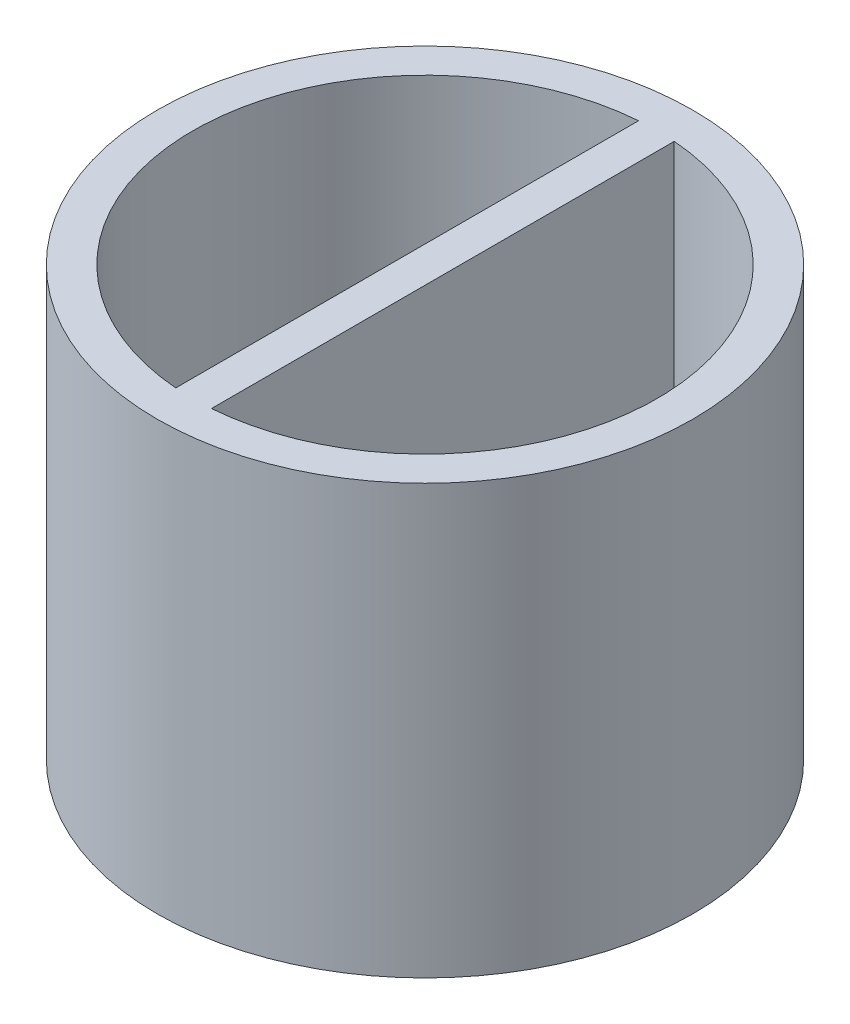
ISO-10303-21;
HEADER;
FILE_DESCRIPTION(('STEP AP214'),'2;1');
FILE_NAME('part.step','',(''),(''),'','','');
FILE_SCHEMA(('AUTOMOTIVE_DESIGN { 1 0 10303 214 1 1 1 1 }'));
ENDSEC;
DATA;
#1=APPLICATION_CONTEXT('core data for automotive mechanical design processes');
#2=APPLICATION_PROTOCOL_DEFINITION('international standard','automotive_design',2000,#1);
#3=PRODUCT_CONTEXT('',#1,'mechanical');
#4=PRODUCT('Part','Part','',(#3));
#5=PRODUCT_RELATED_PRODUCT_CATEGORY('part','',(#4));
#6=PRODUCT_DEFINITION_FORMATION('','',#4);
#7=PRODUCT_DEFINITION_CONTEXT('part definition',#1,'design');
#8=PRODUCT_DEFINITION('design','',#6,#7);
#9=PRODUCT_DEFINITION_SHAPE('','',#8);
#10=(LENGTH_UNIT() NAMED_UNIT(*) SI_UNIT(.MILLI.,.METRE.));
#11=(NAMED_UNIT(*) PLANE_ANGLE_UNIT() SI_UNIT($,.RADIAN.));
#12=(NAMED_UNIT(*) SI_UNIT($,.STERADIAN.) SOLID_ANGLE_UNIT());
#13=UNCERTAINTY_MEASURE_WITH_UNIT(LENGTH_MEASURE(1.E-05),#10,'distance_accuracy_value','');
#14=(GEOMETRIC_REPRESENTATION_CONTEXT(3) GLOBAL_UNCERTAINTY_ASSIGNED_CONTEXT((#13)) GLOBAL_UNIT_ASSIGNED_CONTEXT((#10,
#11,#12)) REPRESENTATION_CONTEXT('',''));
#15=CARTESIAN_POINT('',(0.,0.,0.));
#16=DIRECTION('',(0.,0.,1.));
#17=DIRECTION('',(1.,0.,0.));
#18=AXIS2_PLACEMENT_3D('',#15,#16,#17);
#19=CARTESIAN_POINT('',(0.,60.,0.));
#20=DIRECTION('',(0.,1.,0.));
#21=DIRECTION('',(0.,0.,1.));
#22=AXIS2_PLACEMENT_3D('',#19,#20,#21);
#23=PLANE('',#22);
#24=DIRECTION('',(0.,0.,1.));
#25=VECTOR('',#24,1.);
#26=CARTESIAN_POINT('',(2.5,60.,0.));
#27=LINE('',#26,#25);
#28=CARTESIAN_POINT('',(2.5,60.,-32.4037034920393));
#29=VERTEX_POINT('',#28);
#30=CARTESIAN_POINT('',(2.5,60.,32.4037034920393));
#31=VERTEX_POINT('',#30);
#32=EDGE_CURVE('E69',#29,#31,#27,.T.);
#33=ORIENTED_EDGE('',*,*,#32,.F.);
#34=CARTESIAN_POINT('',(0.,60.,0.));
#35=DIRECTION('',(0.,1.,0.));
#36=DIRECTION('',(0.,0.,1.));
#37=AXIS2_PLACEMENT_3D('',#34,#35,#36);
#38=CIRCLE('',#37,32.5);
#39=EDGE_CURVE('E120',#31,#29,#38,.T.);
#40=ORIENTED_EDGE('',*,*,#39,.F.);
#41=EDGE_LOOP('',(#33,#40));
#42=FACE_BOUND('',#41,.T.);
#43=CARTESIAN_POINT('',(0.,60.,0.));
#44=DIRECTION('',(0.,1.,0.));
#45=DIRECTION('',(0.,0.,1.));
#46=AXIS2_PLACEMENT_3D('',#43,#44,#45);
#47=CIRCLE('',#46,37.5);
#48=CARTESIAN_POINT('',(0.,60.,37.5));
#49=VERTEX_POINT('',#48);
#50=EDGE_CURVE('E11',#49,#49,#47,.T.);
#51=ORIENTED_EDGE('',*,*,#50,.T.);
#52=EDGE_LOOP('',(#51));
#53=FACE_BOUND('',#52,.T.);
#54=CARTESIAN_POINT('',(0.,60.,0.));
#55=DIRECTION('',(0.,1.,0.));
#56=DIRECTION('',(0.,0.,1.));
#57=AXIS2_PLACEMENT_3D('',#54,#55,#56);
#58=CIRCLE('',#57,32.5);
#59=CARTESIAN_POINT('',(-2.5,60.,-32.4037034920393));
#60=VERTEX_POINT('',#59);
#61=CARTESIAN_POINT('',(-2.5,60.,32.4037034920393));
#62=VERTEX_POINT('',#61);
#63=EDGE_CURVE('E101',#60,#62,#58,.T.);
#64=ORIENTED_EDGE('',*,*,#63,.F.);
#65=DIRECTION('',(0.,0.,1.));
#66=VECTOR('',#65,1.);
#67=CARTESIAN_POINT('',(-2.5,60.,0.));
#68=LINE('',#67,#66);
#69=EDGE_CURVE('E61',#60,#62,#68,.T.);
#70=ORIENTED_EDGE('',*,*,#69,.T.);
#71=EDGE_LOOP('',(#64,#70));
#72=FACE_BOUND('',#71,.T.);
#73=ADVANCED_FACE('F45',(#42,#53,#72),#23,.T.);
#74=CARTESIAN_POINT('',(0.,60.,0.));
#75=DIRECTION('',(0.,-1.,0.));
#76=DIRECTION('',(0.,0.,-1.));
#77=AXIS2_PLACEMENT_3D('',#74,#75,#76);
#78=CYLINDRICAL_SURFACE('',#77,37.5);
#79=ORIENTED_EDGE('',*,*,#50,.F.);
#80=EDGE_LOOP('',(#79));
#81=FACE_BOUND('',#80,.T.);
#82=CARTESIAN_POINT('',(0.,0.,0.));
#83=DIRECTION('',(0.,1.,0.));
#84=DIRECTION('',(0.,0.,1.));
#85=AXIS2_PLACEMENT_3D('',#82,#83,#84);
#86=CIRCLE('',#85,37.5);
#87=CARTESIAN_POINT('',(0.,0.,37.5));
#88=VERTEX_POINT('',#87);
#89=EDGE_CURVE('E49',#88,#88,#86,.T.);
#90=ORIENTED_EDGE('',*,*,#89,.T.);
#91=EDGE_LOOP('',(#90));
#92=FACE_BOUND('',#91,.T.);
#93=ADVANCED_FACE('F47',(#81,#92),#78,.T.);
#94=CARTESIAN_POINT('',(0.,0.,0.));
#95=DIRECTION('',(0.,1.,0.));
#96=DIRECTION('',(0.,0.,1.));
#97=AXIS2_PLACEMENT_3D('',#94,#95,#96);
#98=PLANE('',#97);
#99=CARTESIAN_POINT('',(0.,0.,0.));
#100=DIRECTION('',(0.,-1.,0.));
#101=DIRECTION('',(0.,0.,-1.));
#102=AXIS2_PLACEMENT_3D('',#99,#100,#101);
#103=CIRCLE('',#102,10.35);
#104=CARTESIAN_POINT('',(0.,0.,-10.35));
#105=VERTEX_POINT('',#104);
#106=EDGE_CURVE('E186',#105,#105,#103,.T.);
#107=ORIENTED_EDGE('',*,*,#106,.F.);
#108=EDGE_LOOP('',(#107));
#109=FACE_BOUND('',#108,.T.);
#110=ORIENTED_EDGE('',*,*,#89,.F.);
#111=EDGE_LOOP('',(#110));
#112=FACE_BOUND('',#111,.T.);
#113=ADVANCED_FACE('F148',(#109,#112),#98,.F.);
#114=CARTESIAN_POINT('',(2.5,9.99999999999999,0.));
#115=DIRECTION('',(-1.,0.,0.));
#116=DIRECTION('',(0.,0.,1.));
#117=AXIS2_PLACEMENT_3D('',#114,#115,#116);
#118=PLANE('',#117);
#119=ORIENTED_EDGE('',*,*,#32,.T.);
#120=DIRECTION('',(0.,1.,0.));
#121=VECTOR('',#120,1.);
#122=CARTESIAN_POINT('',(2.5,9.99999999999999,32.4037034920393));
#123=LINE('',#122,#121);
#124=CARTESIAN_POINT('',(2.5,9.99999999999999,32.4037034920393));
#125=VERTEX_POINT('',#124);
#126=EDGE_CURVE('E124',#125,#31,#123,.T.);
#127=ORIENTED_EDGE('',*,*,#126,.F.);
#128=DIRECTION('',(0.,0.,1.));
#129=VECTOR('',#128,1.);
#130=CARTESIAN_POINT('',(2.5,9.99999999999999,0.));
#131=LINE('',#130,#129);
#132=CARTESIAN_POINT('',(2.5,9.99999999999999,-32.4037034920393));
#133=VERTEX_POINT('',#132);
#134=EDGE_CURVE('E115',#133,#125,#131,.T.);
#135=ORIENTED_EDGE('',*,*,#134,.F.);
#136=DIRECTION('',(0.,1.,0.));
#137=VECTOR('',#136,1.);
#138=CARTESIAN_POINT('',(2.5,9.99999999999999,-32.4037034920393));
#139=LINE('',#138,#137);
#140=EDGE_CURVE('E110',#133,#29,#139,.T.);
#141=ORIENTED_EDGE('',*,*,#140,.T.);
#142=EDGE_LOOP('',(#119,#127,#135,#141));
#143=FACE_BOUND('',#142,.T.);
#144=ADVANCED_FACE('F154',(#143),#118,.F.);
#145=CARTESIAN_POINT('',(0.,9.99999999999999,0.));
#146=DIRECTION('',(0.,1.,0.));
#147=DIRECTION('',(0.,0.,1.));
#148=AXIS2_PLACEMENT_3D('',#145,#146,#147);
#149=CYLINDRICAL_SURFACE('',#148,32.5);
#150=ORIENTED_EDGE('',*,*,#39,.T.);
#151=ORIENTED_EDGE('',*,*,#140,.F.);
#152=CARTESIAN_POINT('',(0.,9.99999999999999,0.));
#153=DIRECTION('',(0.,1.,0.));
#154=DIRECTION('',(0.,0.,1.));
#155=AXIS2_PLACEMENT_3D('',#152,#153,#154);
#156=CIRCLE('',#155,32.5);
#157=EDGE_CURVE('E119',#125,#133,#156,.T.);
#158=ORIENTED_EDGE('',*,*,#157,.F.);
#159=ORIENTED_EDGE('',*,*,#126,.T.);
#160=EDGE_LOOP('',(#150,#151,#158,#159));
#161=FACE_BOUND('',#160,.T.);
#162=ADVANCED_FACE('F137',(#161),#149,.F.);
#163=CARTESIAN_POINT('',(0.,9.99999999999999,0.));
#164=DIRECTION('',(0.,1.,0.));
#165=DIRECTION('',(0.,0.,1.));
#166=AXIS2_PLACEMENT_3D('',#163,#164,#165);
#167=PLANE('',#166);
#168=ORIENTED_EDGE('',*,*,#134,.T.);
#169=ORIENTED_EDGE('',*,*,#157,.T.);
#170=EDGE_LOOP('',(#168,#169));
#171=FACE_BOUND('',#170,.T.);
#172=ADVANCED_FACE('F166',(#171),#167,.T.);
#173=CARTESIAN_POINT('',(-2.5,9.99999999999999,0.));
#174=DIRECTION('',(-1.,0.,0.));
#175=DIRECTION('',(0.,0.,1.));
#176=AXIS2_PLACEMENT_3D('',#173,#174,#175);
#177=PLANE('',#176);
#178=ORIENTED_EDGE('',*,*,#69,.F.);
#179=DIRECTION('',(0.,1.,0.));
#180=VECTOR('',#179,1.);
#181=CARTESIAN_POINT('',(-2.5,9.99999999999999,-32.4037034920393));
#182=LINE('',#181,#180);
#183=CARTESIAN_POINT('',(-2.5,9.99999999999999,-32.4037034920393));
#184=VERTEX_POINT('',#183);
#185=EDGE_CURVE('E84',#184,#60,#182,.T.);
#186=ORIENTED_EDGE('',*,*,#185,.F.);
#187=DIRECTION('',(0.,0.,1.));
#188=VECTOR('',#187,1.);
#189=CARTESIAN_POINT('',(-2.5,9.99999999999999,0.));
#190=LINE('',#189,#188);
#191=CARTESIAN_POINT('',(-2.5,9.99999999999999,32.4037034920393));
#192=VERTEX_POINT('',#191);
#193=EDGE_CURVE('E87',#184,#192,#190,.T.);
#194=ORIENTED_EDGE('',*,*,#193,.T.);
#195=DIRECTION('',(0.,1.,0.));
#196=VECTOR('',#195,1.);
#197=CARTESIAN_POINT('',(-2.5,9.99999999999999,32.4037034920393));
#198=LINE('',#197,#196);
#199=EDGE_CURVE('E94',#192,#62,#198,.T.);
#200=ORIENTED_EDGE('',*,*,#199,.T.);
#201=EDGE_LOOP('',(#178,#186,#194,#200));
#202=FACE_BOUND('',#201,.T.);
#203=ADVANCED_FACE('F86',(#202),#177,.T.);
#204=CARTESIAN_POINT('',(0.,9.99999999999999,0.));
#205=DIRECTION('',(0.,1.,0.));
#206=DIRECTION('',(0.,0.,1.));
#207=AXIS2_PLACEMENT_3D('',#204,#205,#206);
#208=CYLINDRICAL_SURFACE('',#207,32.5);
#209=ORIENTED_EDGE('',*,*,#63,.T.);
#210=ORIENTED_EDGE('',*,*,#199,.F.);
#211=CARTESIAN_POINT('',(0.,9.99999999999999,0.));
#212=DIRECTION('',(0.,1.,0.));
#213=DIRECTION('',(0.,0.,1.));
#214=AXIS2_PLACEMENT_3D('',#211,#212,#213);
#215=CIRCLE('',#214,32.5);
#216=EDGE_CURVE('E95',#184,#192,#215,.T.);
#217=ORIENTED_EDGE('',*,*,#216,.F.);
#218=ORIENTED_EDGE('',*,*,#185,.T.);
#219=EDGE_LOOP('',(#209,#210,#217,#218));
#220=FACE_BOUND('',#219,.T.);
#221=ADVANCED_FACE('F103',(#220),#208,.F.);
#222=CARTESIAN_POINT('',(0.,9.99999999999999,0.));
#223=DIRECTION('',(0.,1.,0.));
#224=DIRECTION('',(0.,0.,1.));
#225=AXIS2_PLACEMENT_3D('',#222,#223,#224);
#226=PLANE('',#225);
#227=ORIENTED_EDGE('',*,*,#193,.F.);
#228=ORIENTED_EDGE('',*,*,#216,.T.);
#229=EDGE_LOOP('',(#227,#228));
#230=FACE_BOUND('',#229,.T.);
#231=ADVANCED_FACE('F99',(#230),#226,.T.);
#232=CARTESIAN_POINT('',(0.,5.,0.));
#233=DIRECTION('',(0.,-1.,0.));
#234=DIRECTION('',(0.,0.,-1.));
#235=AXIS2_PLACEMENT_3D('',#232,#233,#234);
#236=CYLINDRICAL_SURFACE('',#235,10.35);
#237=CARTESIAN_POINT('',(0.,5.,0.));
#238=DIRECTION('',(0.,-1.,0.));
#239=DIRECTION('',(0.,0.,-1.));
#240=AXIS2_PLACEMENT_3D('',#237,#238,#239);
#241=CIRCLE('',#240,10.35);
#242=CARTESIAN_POINT('',(0.,5.,-10.35));
#243=VERTEX_POINT('',#242);
#244=EDGE_CURVE('E127',#243,#243,#241,.T.);
#245=ORIENTED_EDGE('',*,*,#244,.F.);
#246=EDGE_LOOP('',(#245));
#247=FACE_BOUND('',#246,.T.);
#248=ORIENTED_EDGE('',*,*,#106,.T.);
#249=EDGE_LOOP('',(#248));
#250=FACE_BOUND('',#249,.T.);
#251=ADVANCED_FACE('F175',(#247,#250),#236,.F.);
#252=CARTESIAN_POINT('',(0.,5.,0.));
#253=DIRECTION('',(0.,-1.,0.));
#254=DIRECTION('',(0.,0.,-1.));
#255=AXIS2_PLACEMENT_3D('',#252,#253,#254);
#256=PLANE('',#255);
#257=ORIENTED_EDGE('',*,*,#244,.T.);
#258=EDGE_LOOP('',(#257));
#259=FACE_BOUND('',#258,.T.);
#260=ADVANCED_FACE('F177',(#259),#256,.T.);
#261=CLOSED_SHELL('',(#73,#93,#113,#144,#162,#172,#203,#221,#231,#251,#260));
#262=MANIFOLD_SOLID_BREP('B2',#261);
#263=ADVANCED_BREP_SHAPE_REPRESENTATION('',(#18,#262),#14);
#264=SHAPE_DEFINITION_REPRESENTATION(#9,#263);
ENDSEC;
END-ISO-10303-21;
